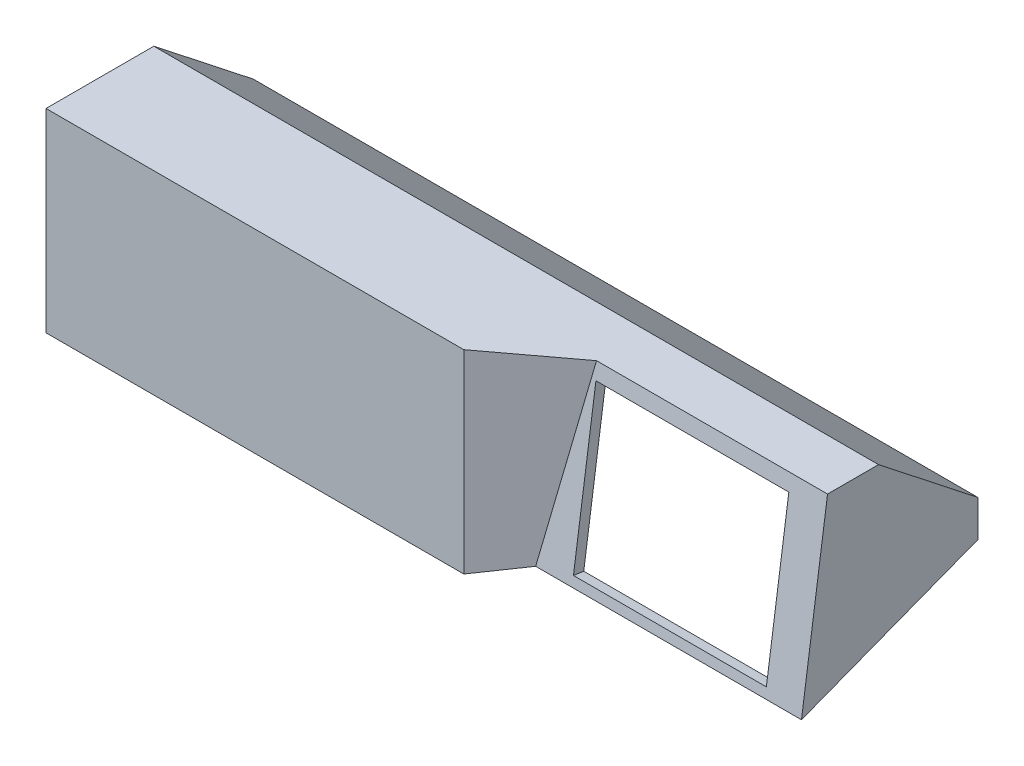
ISO-10303-21;
HEADER;
FILE_DESCRIPTION(('STEP AP214'),'2;1');
FILE_NAME('part.step','',(''),(''),'','','');
FILE_SCHEMA(('AUTOMOTIVE_DESIGN { 1 0 10303 214 1 1 1 1 }'));
ENDSEC;
DATA;
#1=APPLICATION_CONTEXT('core data for automotive mechanical design processes');
#2=APPLICATION_PROTOCOL_DEFINITION('international standard','automotive_design',2000,#1);
#3=PRODUCT_CONTEXT('',#1,'mechanical');
#4=PRODUCT('Part','Part','',(#3));
#5=PRODUCT_RELATED_PRODUCT_CATEGORY('part','',(#4));
#6=PRODUCT_DEFINITION_FORMATION('','',#4);
#7=PRODUCT_DEFINITION_CONTEXT('part definition',#1,'design');
#8=PRODUCT_DEFINITION('design','',#6,#7);
#9=PRODUCT_DEFINITION_SHAPE('','',#8);
#10=(LENGTH_UNIT() NAMED_UNIT(*) SI_UNIT(.MILLI.,.METRE.));
#11=(NAMED_UNIT(*) PLANE_ANGLE_UNIT() SI_UNIT($,.RADIAN.));
#12=(NAMED_UNIT(*) SI_UNIT($,.STERADIAN.) SOLID_ANGLE_UNIT());
#13=UNCERTAINTY_MEASURE_WITH_UNIT(LENGTH_MEASURE(1.E-05),#10,'distance_accuracy_value','');
#14=(GEOMETRIC_REPRESENTATION_CONTEXT(3) GLOBAL_UNCERTAINTY_ASSIGNED_CONTEXT((#13)) GLOBAL_UNIT_ASSIGNED_CONTEXT((#10,
#11,#12)) REPRESENTATION_CONTEXT('',''));
#15=CARTESIAN_POINT('',(0.,0.,0.));
#16=DIRECTION('',(0.,0.,1.));
#17=DIRECTION('',(1.,0.,0.));
#18=AXIS2_PLACEMENT_3D('',#15,#16,#17);
#19=CARTESIAN_POINT('',(35.,0.,0.));
#20=DIRECTION('',(0.,0.933360105545826,0.35894137874517));
#21=DIRECTION('',(0.,-0.35894137874517,0.933360105545826));
#22=AXIS2_PLACEMENT_3D('',#19,#20,#21);
#23=PLANE('',#22);
#24=DIRECTION('',(-1.,0.,0.));
#25=VECTOR('',#24,1.);
#26=CARTESIAN_POINT('',(-19.8658129201116,-2.2700656358859,5.90288227262494));
#27=LINE('',#26,#25);
#28=CARTESIAN_POINT('',(-19.8658129201116,-2.2700656358859,5.90288227262494));
#29=VERTEX_POINT('',#28);
#30=CARTESIAN_POINT('',(-100.,-2.27006563588591,5.90288227262494));
#31=VERTEX_POINT('',#30);
#32=EDGE_CURVE('E256',#29,#31,#27,.T.);
#33=ORIENTED_EDGE('',*,*,#32,.T.);
#34=DIRECTION('',(0.,-0.35894137874517,0.933360105545826));
#35=VECTOR('',#34,1.);
#36=CARTESIAN_POINT('',(-100.,13.0204081632653,-33.8571428571429));
#37=LINE('',#36,#35);
#38=CARTESIAN_POINT('',(-100.,13.0204081632653,-33.8571428571429));
#39=VERTEX_POINT('',#38);
#40=EDGE_CURVE('E240',#39,#31,#37,.T.);
#41=ORIENTED_EDGE('',*,*,#40,.F.);
#42=DIRECTION('',(-1.,0.,0.));
#43=VECTOR('',#42,1.);
#44=CARTESIAN_POINT('',(35.,13.0204081632653,-33.8571428571429));
#45=LINE('',#44,#43);
#46=CARTESIAN_POINT('',(39.,13.0204081632653,-33.8571428571429));
#47=VERTEX_POINT('',#46);
#48=EDGE_CURVE('E49',#47,#39,#45,.T.);
#49=ORIENTED_EDGE('',*,*,#48,.F.);
#50=DIRECTION('',(0.,0.35894137874517,-0.933360105545826));
#51=VECTOR('',#50,1.);
#52=CARTESIAN_POINT('',(39.,0.,0.));
#53=LINE('',#52,#51);
#54=CARTESIAN_POINT('',(39.,0.,0.));
#55=VERTEX_POINT('',#54);
#56=EDGE_CURVE('E209',#55,#47,#53,.T.);
#57=ORIENTED_EDGE('',*,*,#56,.F.);
#58=DIRECTION('',(-1.,0.,0.));
#59=VECTOR('',#58,1.);
#60=CARTESIAN_POINT('',(35.,0.,0.));
#61=LINE('',#60,#59);
#62=CARTESIAN_POINT('',(-11.9858593623443,0.,0.));
#63=VERTEX_POINT('',#62);
#64=EDGE_CURVE('E343',#55,#63,#61,.T.);
#65=ORIENTED_EDGE('',*,*,#64,.T.);
#66=DIRECTION('',(-0.779884292121467,-0.224669919503152,0.584212220150046));
#67=VECTOR('',#66,1.);
#68=CARTESIAN_POINT('',(-11.4180175277529,0.163584496516947,-0.425370971350487));
#69=LINE('',#68,#67);
#70=EDGE_CURVE('E259',#63,#29,#69,.T.);
#71=ORIENTED_EDGE('',*,*,#70,.T.);
#72=EDGE_LOOP('',(#33,#41,#49,#57,#65,#71));
#73=FACE_BOUND('',#72,.T.);
#74=DIRECTION('',(0.,0.35894137874517,-0.933360105545826));
#75=VECTOR('',#74,1.);
#76=CARTESIAN_POINT('',(37.,12.2512701283045,-31.8571428571429));
#77=LINE('',#76,#75);
#78=CARTESIAN_POINT('',(37.,0.822112303229189,-2.13774970385145));
#79=VERTEX_POINT('',#78);
#80=CARTESIAN_POINT('',(37.,12.2512701283045,-31.8571428571429));
#81=VERTEX_POINT('',#80);
#82=EDGE_CURVE('E170',#79,#81,#77,.T.);
#83=ORIENTED_EDGE('',*,*,#82,.T.);
#84=DIRECTION('',(-1.,0.,0.));
#85=VECTOR('',#84,1.);
#86=CARTESIAN_POINT('',(35.,12.2512701283045,-31.8571428571429));
#87=LINE('',#86,#85);
#88=CARTESIAN_POINT('',(-33.,12.2512701283045,-31.8571428571429));
#89=VERTEX_POINT('',#88);
#90=EDGE_CURVE('E327',#81,#89,#87,.T.);
#91=ORIENTED_EDGE('',*,*,#90,.T.);
#92=DIRECTION('',(0.,0.35894137874517,-0.933360105545826));
#93=VECTOR('',#92,1.);
#94=CARTESIAN_POINT('',(-33.,0.,0.));
#95=LINE('',#94,#93);
#96=CARTESIAN_POINT('',(-33.,0.882584835417453,-2.29499724444757));
#97=VERTEX_POINT('',#96);
#98=EDGE_CURVE('E318',#97,#89,#95,.T.);
#99=ORIENTED_EDGE('',*,*,#98,.F.);
#100=DIRECTION('',(-1.,0.,0.));
#101=VECTOR('',#100,1.);
#102=CARTESIAN_POINT('',(-33.,0.882584835417453,-2.29499724444757));
#103=LINE('',#102,#101);
#104=CARTESIAN_POINT('',(-8.9221913326906,0.882584835417452,-2.29499724444757));
#105=VERTEX_POINT('',#104);
#106=EDGE_CURVE('E222',#105,#97,#103,.T.);
#107=ORIENTED_EDGE('',*,*,#106,.F.);
#108=CARTESIAN_POINT('',(-9.13210629621901,0.822112303229189,-2.13774970385145));
#109=VERTEX_POINT('',#108);
#110=EDGE_CURVE('E56',#105,#109,#69,.T.);
#111=ORIENTED_EDGE('',*,*,#110,.T.);
#112=DIRECTION('',(-1.,0.,0.));
#113=VECTOR('',#112,1.);
#114=CARTESIAN_POINT('',(35.,0.822112303229189,-2.13774970385145));
#115=LINE('',#114,#113);
#116=EDGE_CURVE('E166',#79,#109,#115,.T.);
#117=ORIENTED_EDGE('',*,*,#116,.F.);
#118=EDGE_LOOP('',(#83,#91,#99,#107,#111,#117));
#119=FACE_BOUND('',#118,.T.);
#120=ADVANCED_FACE('F41',(#73,#119),#23,.F.);
#121=CARTESIAN_POINT('',(35.,13.0204081632653,-33.8571428571429));
#122=DIRECTION('',(0.,0.,1.));
#123=DIRECTION('',(1.,0.,0.));
#124=AXIS2_PLACEMENT_3D('',#121,#122,#123);
#125=PLANE('',#124);
#126=ORIENTED_EDGE('',*,*,#48,.T.);
#127=DIRECTION('',(0.,-1.,0.));
#128=VECTOR('',#127,1.);
#129=CARTESIAN_POINT('',(-100.,20.,-33.8571428571429));
#130=LINE('',#129,#128);
#131=CARTESIAN_POINT('',(-100.,20.,-33.8571428571429));
#132=VERTEX_POINT('',#131);
#133=EDGE_CURVE('E236',#132,#39,#130,.T.);
#134=ORIENTED_EDGE('',*,*,#133,.F.);
#135=DIRECTION('',(-1.,0.,0.));
#136=VECTOR('',#135,1.);
#137=CARTESIAN_POINT('',(35.,20.,-33.8571428571429));
#138=LINE('',#137,#136);
#139=CARTESIAN_POINT('',(39.,20.,-33.8571428571429));
#140=VERTEX_POINT('',#139);
#141=EDGE_CURVE('E357',#140,#132,#138,.T.);
#142=ORIENTED_EDGE('',*,*,#141,.F.);
#143=DIRECTION('',(0.,1.,0.));
#144=VECTOR('',#143,1.);
#145=CARTESIAN_POINT('',(39.,13.0204081632653,-33.8571428571429));
#146=LINE('',#145,#144);
#147=EDGE_CURVE('E213',#47,#140,#146,.T.);
#148=ORIENTED_EDGE('',*,*,#147,.F.);
#149=EDGE_LOOP('',(#126,#134,#142,#148));
#150=FACE_BOUND('',#149,.T.);
#151=ADVANCED_FACE('F363',(#150),#125,.F.);
#152=CARTESIAN_POINT('',(35.,35.,-14.7764719501473));
#153=DIRECTION('',(0.,-0.786157297672018,0.618026458427979));
#154=DIRECTION('',(0.,-0.618026458427979,-0.786157297672018));
#155=AXIS2_PLACEMENT_3D('',#152,#153,#154);
#156=PLANE('',#155);
#157=ORIENTED_EDGE('',*,*,#141,.T.);
#158=DIRECTION('',(0.,-0.618026458427979,-0.786157297672018));
#159=VECTOR('',#158,1.);
#160=CARTESIAN_POINT('',(-100.,35.,-14.7764719501473));
#161=LINE('',#160,#159);
#162=CARTESIAN_POINT('',(-100.,35.,-14.7764719501473));
#163=VERTEX_POINT('',#162);
#164=EDGE_CURVE('E226',#163,#132,#161,.T.);
#165=ORIENTED_EDGE('',*,*,#164,.F.);
#166=DIRECTION('',(-1.,0.,0.));
#167=VECTOR('',#166,1.);
#168=CARTESIAN_POINT('',(35.,35.,-14.7764719501473));
#169=LINE('',#168,#167);
#170=CARTESIAN_POINT('',(39.,35.,-14.7764719501473));
#171=VERTEX_POINT('',#170);
#172=EDGE_CURVE('E354',#171,#163,#169,.T.);
#173=ORIENTED_EDGE('',*,*,#172,.F.);
#174=DIRECTION('',(0.,0.618026458427979,0.786157297672018));
#175=VECTOR('',#174,1.);
#176=CARTESIAN_POINT('',(39.,20.,-33.8571428571429));
#177=LINE('',#176,#175);
#178=EDGE_CURVE('E217',#140,#171,#177,.T.);
#179=ORIENTED_EDGE('',*,*,#178,.F.);
#180=EDGE_LOOP('',(#157,#165,#173,#179));
#181=FACE_BOUND('',#180,.T.);
#182=ADVANCED_FACE('F389',(#181),#156,.F.);
#183=CARTESIAN_POINT('',(35.,35.,-5.));
#184=DIRECTION('',(0.,-1.,0.));
#185=DIRECTION('',(0.,0.,-1.));
#186=AXIS2_PLACEMENT_3D('',#183,#184,#185);
#187=PLANE('',#186);
#188=ORIENTED_EDGE('',*,*,#172,.T.);
#189=DIRECTION('',(0.,0.,-1.));
#190=VECTOR('',#189,1.);
#191=CARTESIAN_POINT('',(-100.,35.,5.90288227262494));
#192=LINE('',#191,#190);
#193=CARTESIAN_POINT('',(-100.,35.,5.90288227262494));
#194=VERTEX_POINT('',#193);
#195=EDGE_CURVE('E248',#194,#163,#192,.T.);
#196=ORIENTED_EDGE('',*,*,#195,.F.);
#197=DIRECTION('',(1.,0.,0.));
#198=VECTOR('',#197,1.);
#199=CARTESIAN_POINT('',(-19.8658129201116,35.,5.90288227262494));
#200=LINE('',#199,#198);
#201=CARTESIAN_POINT('',(-19.8658129201116,35.,5.90288227262494));
#202=VERTEX_POINT('',#201);
#203=EDGE_CURVE('E255',#194,#202,#200,.T.);
#204=ORIENTED_EDGE('',*,*,#203,.T.);
#205=DIRECTION('',(0.800345174812219,0.,-0.599539490905144));
#206=VECTOR('',#205,1.);
#207=CARTESIAN_POINT('',(-5.31119333155532,35.,-5.));
#208=LINE('',#207,#206);
#209=CARTESIAN_POINT('',(-5.31119333155532,35.,-5.));
#210=VERTEX_POINT('',#209);
#211=EDGE_CURVE('E267',#202,#210,#208,.T.);
#212=ORIENTED_EDGE('',*,*,#211,.T.);
#213=DIRECTION('',(-1.,0.,0.));
#214=VECTOR('',#213,1.);
#215=CARTESIAN_POINT('',(35.,35.,-5.));
#216=LINE('',#215,#214);
#217=CARTESIAN_POINT('',(39.,35.,-5.));
#218=VERTEX_POINT('',#217);
#219=EDGE_CURVE('E350',#218,#210,#216,.T.);
#220=ORIENTED_EDGE('',*,*,#219,.F.);
#221=DIRECTION('',(0.,0.,1.));
#222=VECTOR('',#221,1.);
#223=CARTESIAN_POINT('',(39.,35.,-14.7764719501473));
#224=LINE('',#223,#222);
#225=EDGE_CURVE('E195',#171,#218,#224,.T.);
#226=ORIENTED_EDGE('',*,*,#225,.F.);
#227=EDGE_LOOP('',(#188,#196,#204,#212,#220,#226));
#228=FACE_BOUND('',#227,.T.);
#229=ADVANCED_FACE('F379',(#228),#187,.F.);
#230=CARTESIAN_POINT('',(35.,0.,0.));
#231=DIRECTION('',(0.,-0.141421356237309,-0.989949493661167));
#232=DIRECTION('',(0.,0.989949493661167,-0.141421356237309));
#233=AXIS2_PLACEMENT_3D('',#230,#231,#232);
#234=PLANE('',#233);
#235=DIRECTION('',(0.,0.989949493661166,-0.141421356237309));
#236=VECTOR('',#235,1.);
#237=CARTESIAN_POINT('',(32.,32.0301515190165,-4.57573593128807));
#238=LINE('',#237,#236);
#239=CARTESIAN_POINT('',(32.,1.83669196235093,-0.262384566050132));
#240=VERTEX_POINT('',#239);
#241=CARTESIAN_POINT('',(32.,32.0301515190165,-4.57573593128807));
#242=VERTEX_POINT('',#241);
#243=EDGE_CURVE('E280',#240,#242,#238,.T.);
#244=ORIENTED_EDGE('',*,*,#243,.F.);
#245=DIRECTION('',(1.,0.,0.));
#246=VECTOR('',#245,1.);
#247=CARTESIAN_POINT('',(-4.99999999999999,1.83669196235093,-0.262384566050132));
#248=LINE('',#247,#246);
#249=CARTESIAN_POINT('',(-4.99999999999999,1.83669196235093,-0.262384566050132));
#250=VERTEX_POINT('',#249);
#251=EDGE_CURVE('E284',#250,#240,#248,.T.);
#252=ORIENTED_EDGE('',*,*,#251,.F.);
#253=DIRECTION('',(0.,-0.989949493661166,0.141421356237309));
#254=VECTOR('',#253,1.);
#255=CARTESIAN_POINT('',(-5.,32.0301515190165,-4.57573593128807));
#256=LINE('',#255,#254);
#257=CARTESIAN_POINT('',(-5.,32.0301515190165,-4.57573593128807));
#258=VERTEX_POINT('',#257);
#259=EDGE_CURVE('E276',#258,#250,#256,.T.);
#260=ORIENTED_EDGE('',*,*,#259,.F.);
#261=DIRECTION('',(-1.,0.,0.));
#262=VECTOR('',#261,1.);
#263=CARTESIAN_POINT('',(-5.,32.0301515190165,-4.57573593128807));
#264=LINE('',#263,#262);
#265=EDGE_CURVE('E63',#242,#258,#264,.T.);
#266=ORIENTED_EDGE('',*,*,#265,.F.);
#267=EDGE_LOOP('',(#244,#252,#260,#266));
#268=FACE_BOUND('',#267,.T.);
#269=ORIENTED_EDGE('',*,*,#219,.T.);
#270=DIRECTION('',(-0.185511112680703,-0.972766115019704,0.138966587859958));
#271=VECTOR('',#270,1.);
#272=CARTESIAN_POINT('',(-10.3688704759045,8.47901764138199,-1.21128823448314));
#273=LINE('',#272,#271);
#274=EDGE_CURVE('E263',#210,#63,#273,.T.);
#275=ORIENTED_EDGE('',*,*,#274,.T.);
#276=ORIENTED_EDGE('',*,*,#64,.F.);
#277=DIRECTION('',(0.,-0.989949493661166,0.141421356237309));
#278=VECTOR('',#277,1.);
#279=CARTESIAN_POINT('',(39.,35.,-5.));
#280=LINE('',#279,#278);
#281=EDGE_CURVE('E200',#218,#55,#280,.T.);
#282=ORIENTED_EDGE('',*,*,#281,.F.);
#283=EDGE_LOOP('',(#269,#275,#276,#282));
#284=FACE_BOUND('',#283,.T.);
#285=ADVANCED_FACE('F384',(#268,#284),#234,.F.);
#286=CARTESIAN_POINT('',(35.,13.0204081632653,-31.8571428571429));
#287=DIRECTION('',(0.,0.,1.));
#288=DIRECTION('',(1.,0.,0.));
#289=AXIS2_PLACEMENT_3D('',#286,#287,#288);
#290=PLANE('',#289);
#291=DIRECTION('',(0.,1.,0.));
#292=VECTOR('',#291,1.);
#293=CARTESIAN_POINT('',(-33.,13.0204081632653,-31.8571428571429));
#294=LINE('',#293,#292);
#295=CARTESIAN_POINT('',(-33.,19.0282516165578,-31.8571428571429));
#296=VERTEX_POINT('',#295);
#297=EDGE_CURVE('E319',#89,#296,#294,.T.);
#298=ORIENTED_EDGE('',*,*,#297,.F.);
#299=ORIENTED_EDGE('',*,*,#90,.F.);
#300=DIRECTION('',(0.,1.,0.));
#301=VECTOR('',#300,1.);
#302=CARTESIAN_POINT('',(37.,19.0282516165578,-31.8571428571429));
#303=LINE('',#302,#301);
#304=CARTESIAN_POINT('',(37.,19.0282516165578,-31.8571428571429));
#305=VERTEX_POINT('',#304);
#306=EDGE_CURVE('E193',#81,#305,#303,.T.);
#307=ORIENTED_EDGE('',*,*,#306,.T.);
#308=DIRECTION('',(-1.,0.,0.));
#309=VECTOR('',#308,1.);
#310=CARTESIAN_POINT('',(35.,19.0282516165578,-31.8571428571429));
#311=LINE('',#310,#309);
#312=EDGE_CURVE('E323',#305,#296,#311,.T.);
#313=ORIENTED_EDGE('',*,*,#312,.T.);
#314=EDGE_LOOP('',(#298,#299,#307,#313));
#315=FACE_BOUND('',#314,.T.);
#316=ADVANCED_FACE('F433',(#315),#290,.T.);
#317=CARTESIAN_POINT('',(35.,33.427685404656,-13.5404190332913));
#318=DIRECTION('',(0.,-0.786157297672018,0.618026458427979));
#319=DIRECTION('',(0.,-0.618026458427979,-0.786157297672018));
#320=AXIS2_PLACEMENT_3D('',#317,#318,#319);
#321=PLANE('',#320);
#322=DIRECTION('',(0.,0.618026458427979,0.786157297672018));
#323=VECTOR('',#322,1.);
#324=CARTESIAN_POINT('',(-33.,33.427685404656,-13.5404190332913));
#325=LINE('',#324,#323);
#326=CARTESIAN_POINT('',(-33.,33.,-14.0844539971557));
#327=VERTEX_POINT('',#326);
#328=EDGE_CURVE('E322',#296,#327,#325,.T.);
#329=ORIENTED_EDGE('',*,*,#328,.F.);
#330=ORIENTED_EDGE('',*,*,#312,.F.);
#331=DIRECTION('',(0.,0.618026458427979,0.786157297672018));
#332=VECTOR('',#331,1.);
#333=CARTESIAN_POINT('',(37.,33.,-14.0844539971557));
#334=LINE('',#333,#332);
#335=CARTESIAN_POINT('',(37.,33.,-14.0844539971557));
#336=VERTEX_POINT('',#335);
#337=EDGE_CURVE('E202',#305,#336,#334,.T.);
#338=ORIENTED_EDGE('',*,*,#337,.T.);
#339=DIRECTION('',(-1.,0.,0.));
#340=VECTOR('',#339,1.);
#341=CARTESIAN_POINT('',(35.,33.,-14.0844539971557));
#342=LINE('',#341,#340);
#343=EDGE_CURVE('E328',#336,#327,#342,.T.);
#344=ORIENTED_EDGE('',*,*,#343,.T.);
#345=EDGE_LOOP('',(#329,#330,#338,#344));
#346=FACE_BOUND('',#345,.T.);
#347=ADVANCED_FACE('F476',(#346),#321,.T.);
#348=CARTESIAN_POINT('',(35.,33.,-5.));
#349=DIRECTION('',(0.,-1.,0.));
#350=DIRECTION('',(0.,0.,-1.));
#351=AXIS2_PLACEMENT_3D('',#348,#349,#350);
#352=PLANE('',#351);
#353=DIRECTION('',(0.,0.,1.));
#354=VECTOR('',#353,1.);
#355=CARTESIAN_POINT('',(-33.,33.,-5.));
#356=LINE('',#355,#354);
#357=CARTESIAN_POINT('',(-33.,33.,-6.73459080339013));
#358=VERTEX_POINT('',#357);
#359=EDGE_CURVE('E331',#327,#358,#356,.T.);
#360=ORIENTED_EDGE('',*,*,#359,.F.);
#361=ORIENTED_EDGE('',*,*,#343,.F.);
#362=DIRECTION('',(0.,0.,1.));
#363=VECTOR('',#362,1.);
#364=CARTESIAN_POINT('',(37.,33.,-6.73459080339013));
#365=LINE('',#364,#363);
#366=CARTESIAN_POINT('',(37.,33.,-6.73459080339013));
#367=VERTEX_POINT('',#366);
#368=EDGE_CURVE('E187',#336,#367,#365,.T.);
#369=ORIENTED_EDGE('',*,*,#368,.T.);
#370=DIRECTION('',(-1.,0.,0.));
#371=VECTOR('',#370,1.);
#372=CARTESIAN_POINT('',(35.,33.,-6.73459080339013));
#373=LINE('',#372,#371);
#374=EDGE_CURVE('E174',#367,#358,#373,.T.);
#375=ORIENTED_EDGE('',*,*,#374,.T.);
#376=EDGE_LOOP('',(#360,#361,#369,#375));
#377=FACE_BOUND('',#376,.T.);
#378=ADVANCED_FACE('F465',(#377),#352,.T.);
#379=CARTESIAN_POINT('',(35.,-0.282842712474619,-1.97989898732233));
#380=DIRECTION('',(0.,-0.141421356237309,-0.989949493661167));
#381=DIRECTION('',(0.,0.989949493661167,-0.141421356237309));
#382=AXIS2_PLACEMENT_3D('',#379,#380,#381);
#383=PLANE('',#382);
#384=DIRECTION('',(-0.185511112680703,-0.972766115019704,0.138966587859958));
#385=VECTOR('',#384,1.);
#386=CARTESIAN_POINT('',(-7.81679589287514,7.71921605414056,-3.12305023969593));
#387=LINE('',#386,#385);
#388=CARTESIAN_POINT('',(-8.9221913326906,1.92284508740205,-2.29499724444757));
#389=VERTEX_POINT('',#388);
#390=EDGE_CURVE('E12',#389,#109,#387,.T.);
#391=ORIENTED_EDGE('',*,*,#390,.F.);
#392=DIRECTION('',(1.,0.,0.));
#393=VECTOR('',#392,1.);
#394=CARTESIAN_POINT('',(-5.31119333155532,1.92284508740205,-2.29499724444757));
#395=LINE('',#394,#393);
#396=CARTESIAN_POINT('',(-33.,1.92284508740205,-2.29499724444757));
#397=VERTEX_POINT('',#396);
#398=EDGE_CURVE('E252',#397,#389,#395,.T.);
#399=ORIENTED_EDGE('',*,*,#398,.F.);
#400=DIRECTION('',(0.,-0.989949493661167,0.141421356237309));
#401=VECTOR('',#400,1.);
#402=CARTESIAN_POINT('',(-33.,-0.282842712474619,-1.97989898732233));
#403=LINE('',#402,#401);
#404=EDGE_CURVE('E175',#358,#397,#403,.T.);
#405=ORIENTED_EDGE('',*,*,#404,.F.);
#406=ORIENTED_EDGE('',*,*,#374,.F.);
#407=DIRECTION('',(0.,-0.989949493661167,0.141421356237309));
#408=VECTOR('',#407,1.);
#409=CARTESIAN_POINT('',(37.,0.822112303229189,-2.13774970385145));
#410=LINE('',#409,#408);
#411=EDGE_CURVE('E178',#367,#79,#410,.T.);
#412=ORIENTED_EDGE('',*,*,#411,.T.);
#413=ORIENTED_EDGE('',*,*,#116,.T.);
#414=EDGE_LOOP('',(#391,#399,#405,#406,#412,#413));
#415=FACE_BOUND('',#414,.T.);
#416=DIRECTION('',(1.,0.,0.));
#417=VECTOR('',#416,1.);
#418=CARTESIAN_POINT('',(-4.99999999999999,1.55384924987631,-2.24228355337246));
#419=LINE('',#418,#417);
#420=CARTESIAN_POINT('',(-5.,1.55384924987631,-2.24228355337247));
#421=VERTEX_POINT('',#420);
#422=CARTESIAN_POINT('',(32.,1.55384924987631,-2.24228355337246));
#423=VERTEX_POINT('',#422);
#424=EDGE_CURVE('E279',#421,#423,#419,.T.);
#425=ORIENTED_EDGE('',*,*,#424,.T.);
#426=DIRECTION('',(0.,0.989949493661167,-0.141421356237309));
#427=VECTOR('',#426,1.);
#428=CARTESIAN_POINT('',(32.,31.7473088065419,-6.5556349186104));
#429=LINE('',#428,#427);
#430=CARTESIAN_POINT('',(32.,31.7473088065419,-6.5556349186104));
#431=VERTEX_POINT('',#430);
#432=EDGE_CURVE('E306',#423,#431,#429,.T.);
#433=ORIENTED_EDGE('',*,*,#432,.T.);
#434=DIRECTION('',(-1.,0.,0.));
#435=VECTOR('',#434,1.);
#436=CARTESIAN_POINT('',(-5.,31.7473088065419,-6.5556349186104));
#437=LINE('',#436,#435);
#438=CARTESIAN_POINT('',(-5.,31.7473088065419,-6.5556349186104));
#439=VERTEX_POINT('',#438);
#440=EDGE_CURVE('E301',#431,#439,#437,.T.);
#441=ORIENTED_EDGE('',*,*,#440,.T.);
#442=DIRECTION('',(0.,-0.989949493661167,0.141421356237309));
#443=VECTOR('',#442,1.);
#444=CARTESIAN_POINT('',(-5.,31.7473088065419,-6.5556349186104));
#445=LINE('',#444,#443);
#446=EDGE_CURVE('E295',#439,#421,#445,.T.);
#447=ORIENTED_EDGE('',*,*,#446,.T.);
#448=EDGE_LOOP('',(#425,#433,#441,#447));
#449=FACE_BOUND('',#448,.T.);
#450=ADVANCED_FACE('F179',(#415,#449),#383,.T.);
#451=CARTESIAN_POINT('',(-33.,0.,0.));
#452=DIRECTION('',(1.,0.,0.));
#453=DIRECTION('',(0.,0.,-1.));
#454=AXIS2_PLACEMENT_3D('',#451,#452,#453);
#455=PLANE('',#454);
#456=ORIENTED_EDGE('',*,*,#404,.T.);
#457=DIRECTION('',(0.,1.,0.));
#458=VECTOR('',#457,1.);
#459=CARTESIAN_POINT('',(-33.,-27.411074041733,-2.29499724444757));
#460=LINE('',#459,#458);
#461=EDGE_CURVE('E227',#97,#397,#460,.T.);
#462=ORIENTED_EDGE('',*,*,#461,.F.);
#463=ORIENTED_EDGE('',*,*,#98,.T.);
#464=ORIENTED_EDGE('',*,*,#297,.T.);
#465=ORIENTED_EDGE('',*,*,#328,.T.);
#466=ORIENTED_EDGE('',*,*,#359,.T.);
#467=EDGE_LOOP('',(#456,#462,#463,#464,#465,#466));
#468=FACE_BOUND('',#467,.T.);
#469=ADVANCED_FACE('F464',(#468),#455,.T.);
#470=CARTESIAN_POINT('',(-4.99999999999999,-5.22737482841516,-49.7108521014128));
#471=DIRECTION('',(0.,-0.989949493661167,0.141421356237309));
#472=DIRECTION('',(0.,-0.141421356237309,-0.989949493661167));
#473=AXIS2_PLACEMENT_3D('',#470,#471,#472);
#474=PLANE('',#473);
#475=DIRECTION('',(0.,0.141421356237309,0.989949493661167));
#476=VECTOR('',#475,1.);
#477=CARTESIAN_POINT('',(-4.99999999999999,-5.22737482841516,-49.7108521014128));
#478=LINE('',#477,#476);
#479=EDGE_CURVE('E299',#421,#250,#478,.T.);
#480=ORIENTED_EDGE('',*,*,#479,.T.);
#481=ORIENTED_EDGE('',*,*,#251,.T.);
#482=DIRECTION('',(0.,0.141421356237309,0.989949493661167));
#483=VECTOR('',#482,1.);
#484=CARTESIAN_POINT('',(32.,-5.22737482841516,-49.7108521014128));
#485=LINE('',#484,#483);
#486=EDGE_CURVE('E294',#423,#240,#485,.T.);
#487=ORIENTED_EDGE('',*,*,#486,.F.);
#488=ORIENTED_EDGE('',*,*,#424,.F.);
#489=EDGE_LOOP('',(#480,#481,#487,#488));
#490=FACE_BOUND('',#489,.T.);
#491=ADVANCED_FACE('F520',(#490),#474,.F.);
#492=CARTESIAN_POINT('',(32.,24.9660847282504,-54.0242034666507));
#493=DIRECTION('',(1.,0.,0.));
#494=DIRECTION('',(0.,1.,0.));
#495=AXIS2_PLACEMENT_3D('',#492,#493,#494);
#496=PLANE('',#495);
#497=ORIENTED_EDGE('',*,*,#486,.T.);
#498=ORIENTED_EDGE('',*,*,#243,.T.);
#499=DIRECTION('',(0.,0.141421356237309,0.989949493661167));
#500=VECTOR('',#499,1.);
#501=CARTESIAN_POINT('',(32.,24.9660847282504,-54.0242034666507));
#502=LINE('',#501,#500);
#503=EDGE_CURVE('E305',#431,#242,#502,.T.);
#504=ORIENTED_EDGE('',*,*,#503,.F.);
#505=ORIENTED_EDGE('',*,*,#432,.F.);
#506=EDGE_LOOP('',(#497,#498,#504,#505));
#507=FACE_BOUND('',#506,.T.);
#508=ADVANCED_FACE('F532',(#507),#496,.F.);
#509=CARTESIAN_POINT('',(-5.,24.9660847282504,-54.0242034666507));
#510=DIRECTION('',(0.,0.989949493661167,-0.141421356237309));
#511=DIRECTION('',(0.,0.141421356237309,0.989949493661167));
#512=AXIS2_PLACEMENT_3D('',#509,#510,#511);
#513=PLANE('',#512);
#514=ORIENTED_EDGE('',*,*,#503,.T.);
#515=ORIENTED_EDGE('',*,*,#265,.T.);
#516=DIRECTION('',(0.,0.141421356237309,0.989949493661167));
#517=VECTOR('',#516,1.);
#518=CARTESIAN_POINT('',(-5.,24.9660847282504,-54.0242034666507));
#519=LINE('',#518,#517);
#520=EDGE_CURVE('E300',#439,#258,#519,.T.);
#521=ORIENTED_EDGE('',*,*,#520,.F.);
#522=ORIENTED_EDGE('',*,*,#440,.F.);
#523=EDGE_LOOP('',(#514,#515,#521,#522));
#524=FACE_BOUND('',#523,.T.);
#525=ADVANCED_FACE('F541',(#524),#513,.F.);
#526=CARTESIAN_POINT('',(-5.,24.9660847282504,-54.0242034666507));
#527=DIRECTION('',(-1.,0.,0.));
#528=DIRECTION('',(0.,-1.,0.));
#529=AXIS2_PLACEMENT_3D('',#526,#527,#528);
#530=PLANE('',#529);
#531=ORIENTED_EDGE('',*,*,#520,.T.);
#532=ORIENTED_EDGE('',*,*,#259,.T.);
#533=ORIENTED_EDGE('',*,*,#479,.F.);
#534=ORIENTED_EDGE('',*,*,#446,.F.);
#535=EDGE_LOOP('',(#531,#532,#533,#534));
#536=FACE_BOUND('',#535,.T.);
#537=ADVANCED_FACE('F550',(#536),#530,.F.);
#538=CARTESIAN_POINT('',(-5.31119333155532,-32.9301668298492,-5.));
#539=DIRECTION('',(0.599539490905144,0.,0.800345174812219));
#540=DIRECTION('',(0.800345174812219,0.,-0.599539490905144));
#541=AXIS2_PLACEMENT_3D('',#538,#539,#540);
#542=PLANE('',#541);
#543=DIRECTION('',(0.,1.,0.));
#544=VECTOR('',#543,1.);
#545=CARTESIAN_POINT('',(-8.9221913326906,-27.411074041733,-2.29499724444757));
#546=LINE('',#545,#544);
#547=EDGE_CURVE('E221',#105,#389,#546,.T.);
#548=ORIENTED_EDGE('',*,*,#547,.T.);
#549=ORIENTED_EDGE('',*,*,#390,.T.);
#550=ORIENTED_EDGE('',*,*,#110,.F.);
#551=EDGE_LOOP('',(#548,#549,#550));
#552=FACE_BOUND('',#551,.T.);
#553=ADVANCED_FACE('F557',(#552),#542,.T.);
#554=ORIENTED_EDGE('',*,*,#274,.F.);
#555=ORIENTED_EDGE('',*,*,#211,.F.);
#556=DIRECTION('',(0.,1.,0.));
#557=VECTOR('',#556,1.);
#558=CARTESIAN_POINT('',(-19.8658129201116,-32.9301668298492,5.90288227262494));
#559=LINE('',#558,#557);
#560=EDGE_CURVE('E260',#29,#202,#559,.T.);
#561=ORIENTED_EDGE('',*,*,#560,.F.);
#562=ORIENTED_EDGE('',*,*,#70,.F.);
#563=EDGE_LOOP('',(#554,#555,#561,#562));
#564=FACE_BOUND('',#563,.T.);
#565=ADVANCED_FACE('F377',(#564),#542,.T.);
#566=CARTESIAN_POINT('',(-19.8658129201116,-32.9301668298492,5.90288227262494));
#567=DIRECTION('',(0.,0.,1.));
#568=DIRECTION('',(1.,0.,0.));
#569=AXIS2_PLACEMENT_3D('',#566,#567,#568);
#570=PLANE('',#569);
#571=ORIENTED_EDGE('',*,*,#32,.F.);
#572=ORIENTED_EDGE('',*,*,#560,.T.);
#573=ORIENTED_EDGE('',*,*,#203,.F.);
#574=DIRECTION('',(0.,1.,0.));
#575=VECTOR('',#574,1.);
#576=CARTESIAN_POINT('',(-100.,-2.27006563588591,5.90288227262494));
#577=LINE('',#576,#575);
#578=EDGE_CURVE('E244',#31,#194,#577,.T.);
#579=ORIENTED_EDGE('',*,*,#578,.F.);
#580=EDGE_LOOP('',(#571,#572,#573,#579));
#581=FACE_BOUND('',#580,.T.);
#582=ADVANCED_FACE('F374',(#581),#570,.T.);
#583=CARTESIAN_POINT('',(-100.,0.,0.));
#584=DIRECTION('',(-1.,0.,0.));
#585=DIRECTION('',(0.,0.,1.));
#586=AXIS2_PLACEMENT_3D('',#583,#584,#585);
#587=PLANE('',#586);
#588=ORIENTED_EDGE('',*,*,#164,.T.);
#589=ORIENTED_EDGE('',*,*,#133,.T.);
#590=ORIENTED_EDGE('',*,*,#40,.T.);
#591=ORIENTED_EDGE('',*,*,#578,.T.);
#592=ORIENTED_EDGE('',*,*,#195,.T.);
#593=EDGE_LOOP('',(#588,#589,#590,#591,#592));
#594=FACE_BOUND('',#593,.T.);
#595=ADVANCED_FACE('F368',(#594),#587,.T.);
#596=CARTESIAN_POINT('',(-33.,-27.411074041733,-2.29499724444757));
#597=DIRECTION('',(0.,0.,1.));
#598=DIRECTION('',(1.,0.,0.));
#599=AXIS2_PLACEMENT_3D('',#596,#597,#598);
#600=PLANE('',#599);
#601=ORIENTED_EDGE('',*,*,#106,.T.);
#602=ORIENTED_EDGE('',*,*,#461,.T.);
#603=ORIENTED_EDGE('',*,*,#398,.T.);
#604=ORIENTED_EDGE('',*,*,#547,.F.);
#605=EDGE_LOOP('',(#601,#602,#603,#604));
#606=FACE_BOUND('',#605,.T.);
#607=ADVANCED_FACE('F413',(#606),#600,.F.);
#608=CARTESIAN_POINT('',(39.,0.,0.));
#609=DIRECTION('',(-1.,0.,0.));
#610=DIRECTION('',(0.,0.,1.));
#611=AXIS2_PLACEMENT_3D('',#608,#609,#610);
#612=PLANE('',#611);
#613=ORIENTED_EDGE('',*,*,#225,.T.);
#614=ORIENTED_EDGE('',*,*,#281,.T.);
#615=ORIENTED_EDGE('',*,*,#56,.T.);
#616=ORIENTED_EDGE('',*,*,#147,.T.);
#617=ORIENTED_EDGE('',*,*,#178,.T.);
#618=EDGE_LOOP('',(#613,#614,#615,#616,#617));
#619=FACE_BOUND('',#618,.T.);
#620=ADVANCED_FACE('F386',(#619),#612,.F.);
#621=CARTESIAN_POINT('',(37.,0.,0.));
#622=DIRECTION('',(-1.,0.,0.));
#623=DIRECTION('',(0.,0.,1.));
#624=AXIS2_PLACEMENT_3D('',#621,#622,#623);
#625=PLANE('',#624);
#626=ORIENTED_EDGE('',*,*,#306,.F.);
#627=ORIENTED_EDGE('',*,*,#82,.F.);
#628=ORIENTED_EDGE('',*,*,#411,.F.);
#629=ORIENTED_EDGE('',*,*,#368,.F.);
#630=ORIENTED_EDGE('',*,*,#337,.F.);
#631=EDGE_LOOP('',(#626,#627,#628,#629,#630));
#632=FACE_BOUND('',#631,.T.);
#633=ADVANCED_FACE('F190',(#632),#625,.T.);
#634=CLOSED_SHELL('',(#120,#151,#182,#229,#285,#316,#347,#378,#450,#469,#491,#508,#525,#537,
#553,#565,#582,#595,#607,#620,#633));
#635=MANIFOLD_SOLID_BREP('B2',#634);
#636=ADVANCED_BREP_SHAPE_REPRESENTATION('',(#18,#635),#14);
#637=SHAPE_DEFINITION_REPRESENTATION(#9,#636);
ENDSEC;
END-ISO-10303-21;
